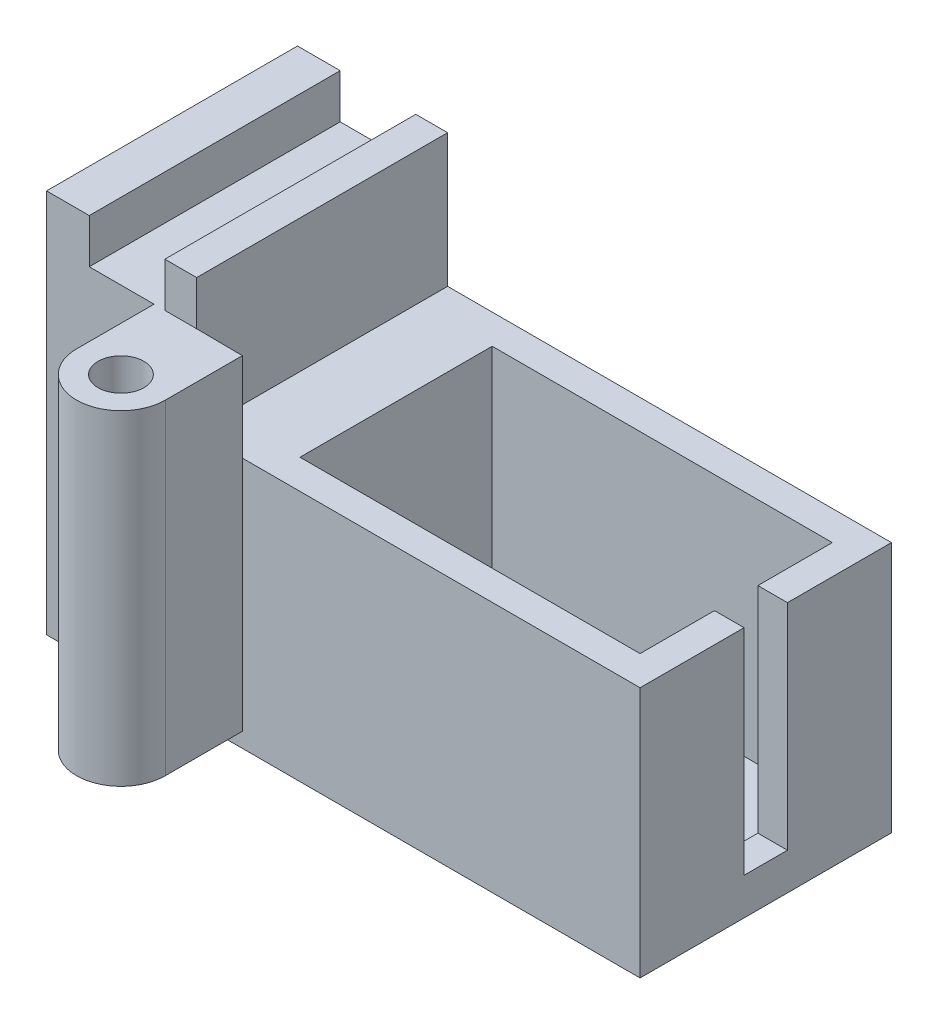
ISO-10303-21;
HEADER;
FILE_DESCRIPTION(('STEP AP214'),'2;1');
FILE_NAME('part.step','',(''),(''),'','','');
FILE_SCHEMA(('AUTOMOTIVE_DESIGN { 1 0 10303 214 1 1 1 1 }'));
ENDSEC;
DATA;
#1=APPLICATION_CONTEXT('core data for automotive mechanical design processes');
#2=APPLICATION_PROTOCOL_DEFINITION('international standard','automotive_design',2000,#1);
#3=PRODUCT_CONTEXT('',#1,'mechanical');
#4=PRODUCT('Part','Part','',(#3));
#5=PRODUCT_RELATED_PRODUCT_CATEGORY('part','',(#4));
#6=PRODUCT_DEFINITION_FORMATION('','',#4);
#7=PRODUCT_DEFINITION_CONTEXT('part definition',#1,'design');
#8=PRODUCT_DEFINITION('design','',#6,#7);
#9=PRODUCT_DEFINITION_SHAPE('','',#8);
#10=(LENGTH_UNIT() NAMED_UNIT(*) SI_UNIT(.MILLI.,.METRE.));
#11=(NAMED_UNIT(*) PLANE_ANGLE_UNIT() SI_UNIT($,.RADIAN.));
#12=(NAMED_UNIT(*) SI_UNIT($,.STERADIAN.) SOLID_ANGLE_UNIT());
#13=UNCERTAINTY_MEASURE_WITH_UNIT(LENGTH_MEASURE(1.E-05),#10,'distance_accuracy_value','');
#14=(GEOMETRIC_REPRESENTATION_CONTEXT(3) GLOBAL_UNCERTAINTY_ASSIGNED_CONTEXT((#13)) GLOBAL_UNIT_ASSIGNED_CONTEXT((#10,
#11,#12)) REPRESENTATION_CONTEXT('',''));
#15=CARTESIAN_POINT('',(0.,0.,0.));
#16=DIRECTION('',(0.,0.,1.));
#17=DIRECTION('',(1.,0.,0.));
#18=AXIS2_PLACEMENT_3D('',#15,#16,#17);
#19=CARTESIAN_POINT('',(-26.668032914112,26.,8.47059048324771));
#20=DIRECTION('',(0.,0.,-1.));
#21=DIRECTION('',(0.,1.,0.));
#22=AXIS2_PLACEMENT_3D('',#19,#20,#21);
#23=PLANE('',#22);
#24=DIRECTION('',(0.,-1.,0.));
#25=VECTOR('',#24,1.);
#26=CARTESIAN_POINT('',(-23.7796119097595,26.,8.47059048324771));
#27=LINE('',#26,#25);
#28=CARTESIAN_POINT('',(-23.7796119097595,26.,8.47059048324771));
#29=VERTEX_POINT('',#28);
#30=CARTESIAN_POINT('',(-23.7796119097595,23.,8.47059048324771));
#31=VERTEX_POINT('',#30);
#32=EDGE_CURVE('E231',#29,#31,#27,.T.);
#33=ORIENTED_EDGE('',*,*,#32,.F.);
#34=DIRECTION('',(1.,0.,0.));
#35=VECTOR('',#34,1.);
#36=CARTESIAN_POINT('',(-26.668032914112,26.,8.47059048324771));
#37=LINE('',#36,#35);
#38=CARTESIAN_POINT('',(-26.668032914112,26.,8.47059048324771));
#39=VERTEX_POINT('',#38);
#40=EDGE_CURVE('E277',#39,#29,#37,.T.);
#41=ORIENTED_EDGE('',*,*,#40,.F.);
#42=DIRECTION('',(0.,-1.,0.));
#43=VECTOR('',#42,1.);
#44=CARTESIAN_POINT('',(-26.668032914112,26.,8.47059048324771));
#45=LINE('',#44,#43);
#46=CARTESIAN_POINT('',(-26.668032914112,0.,8.47059048324771));
#47=VERTEX_POINT('',#46);
#48=EDGE_CURVE('E295',#39,#47,#45,.T.);
#49=ORIENTED_EDGE('',*,*,#48,.T.);
#50=DIRECTION('',(1.,0.,0.));
#51=VECTOR('',#50,1.);
#52=CARTESIAN_POINT('',(-26.668032914112,0.,8.47059048324771));
#53=LINE('',#52,#51);
#54=CARTESIAN_POINT('',(-18.5,0.,8.47059048324771));
#55=VERTEX_POINT('',#54);
#56=EDGE_CURVE('E270',#47,#55,#53,.T.);
#57=ORIENTED_EDGE('',*,*,#56,.T.);
#58=DIRECTION('',(0.,-1.,0.));
#59=VECTOR('',#58,1.);
#60=CARTESIAN_POINT('',(-18.5,0.,8.47059048324771));
#61=LINE('',#60,#59);
#62=CARTESIAN_POINT('',(-18.5,0.999999999999996,8.47059048324771));
#63=VERTEX_POINT('',#62);
#64=EDGE_CURVE('E56',#63,#55,#61,.T.);
#65=ORIENTED_EDGE('',*,*,#64,.F.);
#66=DIRECTION('',(1.,0.,0.));
#67=VECTOR('',#66,1.);
#68=CARTESIAN_POINT('',(-26.668032914112,0.999999999999997,8.47059048324771));
#69=LINE('',#68,#67);
#70=CARTESIAN_POINT('',(-19.3979794014547,0.999999999999997,8.47059048324771));
#71=VERTEX_POINT('',#70);
#72=EDGE_CURVE('E42',#71,#63,#69,.T.);
#73=ORIENTED_EDGE('',*,*,#72,.F.);
#74=DIRECTION('',(0.,1.,0.));
#75=VECTOR('',#74,1.);
#76=CARTESIAN_POINT('',(-19.3979794014547,26.,8.47059048324771));
#77=LINE('',#76,#75);
#78=CARTESIAN_POINT('',(-19.3979794014547,23.,8.47059048324771));
#79=VERTEX_POINT('',#78);
#80=EDGE_CURVE('E396',#71,#79,#77,.T.);
#81=ORIENTED_EDGE('',*,*,#80,.T.);
#82=DIRECTION('',(1.,0.,0.));
#83=VECTOR('',#82,1.);
#84=CARTESIAN_POINT('',(-26.668032914112,23.,8.47059048324771));
#85=LINE('',#84,#83);
#86=EDGE_CURVE('E225',#31,#79,#85,.T.);
#87=ORIENTED_EDGE('',*,*,#86,.F.);
#88=EDGE_LOOP('',(#33,#41,#49,#57,#65,#73,#81,#87));
#89=FACE_BOUND('',#88,.T.);
#90=ADVANCED_FACE('F34',(#89),#23,.F.);
#91=CARTESIAN_POINT('',(0.,26.,0.));
#92=DIRECTION('',(0.,1.,0.));
#93=DIRECTION('',(0.,0.,1.));
#94=AXIS2_PLACEMENT_3D('',#91,#92,#93);
#95=PLANE('',#94);
#96=ORIENTED_EDGE('',*,*,#40,.T.);
#97=DIRECTION('',(0.,0.,-1.));
#98=VECTOR('',#97,1.);
#99=CARTESIAN_POINT('',(-23.7796119097595,26.,0.));
#100=LINE('',#99,#98);
#101=CARTESIAN_POINT('',(-23.7796119097595,26.,-8.5));
#102=VERTEX_POINT('',#101);
#103=EDGE_CURVE('E11',#29,#102,#100,.T.);
#104=ORIENTED_EDGE('',*,*,#103,.T.);
#105=DIRECTION('',(-1.,0.,0.));
#106=VECTOR('',#105,1.);
#107=CARTESIAN_POINT('',(-26.668032914112,26.,-8.5));
#108=LINE('',#107,#106);
#109=CARTESIAN_POINT('',(-26.668032914112,26.,-8.5));
#110=VERTEX_POINT('',#109);
#111=EDGE_CURVE('E282',#102,#110,#108,.T.);
#112=ORIENTED_EDGE('',*,*,#111,.T.);
#113=DIRECTION('',(0.,0.,1.));
#114=VECTOR('',#113,1.);
#115=CARTESIAN_POINT('',(-26.668032914112,26.,-8.5));
#116=LINE('',#115,#114);
#117=EDGE_CURVE('E273',#110,#39,#116,.T.);
#118=ORIENTED_EDGE('',*,*,#117,.T.);
#119=EDGE_LOOP('',(#96,#104,#112,#118));
#120=FACE_BOUND('',#119,.T.);
#121=ADVANCED_FACE('F470',(#120),#95,.T.);
#122=CARTESIAN_POINT('',(-18.5,0.,0.));
#123=DIRECTION('',(-1.,0.,0.));
#124=DIRECTION('',(0.,0.,1.));
#125=AXIS2_PLACEMENT_3D('',#122,#123,#124);
#126=PLANE('',#125);
#127=DIRECTION('',(0.,1.,0.));
#128=VECTOR('',#127,1.);
#129=CARTESIAN_POINT('',(-18.5,0.,8.5));
#130=LINE('',#129,#128);
#131=CARTESIAN_POINT('',(-18.5,0.,8.5));
#132=VERTEX_POINT('',#131);
#133=CARTESIAN_POINT('',(-18.5,0.999999999999997,8.5));
#134=VERTEX_POINT('',#133);
#135=EDGE_CURVE('E300',#132,#134,#130,.T.);
#136=ORIENTED_EDGE('',*,*,#135,.T.);
#137=DIRECTION('',(0.,0.,-1.));
#138=VECTOR('',#137,1.);
#139=CARTESIAN_POINT('',(-18.5,0.999999999999996,0.));
#140=LINE('',#139,#138);
#141=EDGE_CURVE('E263',#134,#63,#140,.T.);
#142=ORIENTED_EDGE('',*,*,#141,.T.);
#143=ORIENTED_EDGE('',*,*,#64,.T.);
#144=DIRECTION('',(0.,0.,1.));
#145=VECTOR('',#144,1.);
#146=CARTESIAN_POINT('',(-18.5,0.,-8.5));
#147=LINE('',#146,#145);
#148=EDGE_CURVE('E298',#55,#132,#147,.T.);
#149=ORIENTED_EDGE('',*,*,#148,.T.);
#150=EDGE_LOOP('',(#136,#142,#143,#149));
#151=FACE_BOUND('',#150,.T.);
#152=ADVANCED_FACE('F405',(#151),#126,.T.);
#153=CARTESIAN_POINT('',(-18.6677867119016,26.,8.47059048324771));
#154=VERTEX_POINT('',#153);
#155=CARTESIAN_POINT('',(-16.5155395499797,26.,8.47059048324771));
#156=VERTEX_POINT('',#155);
#157=EDGE_CURVE('E276',#154,#156,#37,.T.);
#158=ORIENTED_EDGE('',*,*,#157,.F.);
#159=DIRECTION('',(0.,-1.,0.));
#160=VECTOR('',#159,1.);
#161=CARTESIAN_POINT('',(-18.6677867119016,26.,8.47059048324771));
#162=LINE('',#161,#160);
#163=CARTESIAN_POINT('',(-18.6677867119016,23.,8.47059048324771));
#164=VERTEX_POINT('',#163);
#165=EDGE_CURVE('E212',#154,#164,#162,.T.);
#166=ORIENTED_EDGE('',*,*,#165,.T.);
#167=DIRECTION('',(1.,0.,0.));
#168=VECTOR('',#167,1.);
#169=CARTESIAN_POINT('',(-26.668032914112,23.,8.47059048324771));
#170=LINE('',#169,#168);
#171=CARTESIAN_POINT('',(-16.5155395499797,23.,8.47059048324771));
#172=VERTEX_POINT('',#171);
#173=EDGE_CURVE('E220',#164,#172,#170,.T.);
#174=ORIENTED_EDGE('',*,*,#173,.T.);
#175=DIRECTION('',(0.,-1.,0.));
#176=VECTOR('',#175,1.);
#177=CARTESIAN_POINT('',(-16.5155395499797,26.,8.47059048324771));
#178=LINE('',#177,#176);
#179=EDGE_CURVE('E292',#156,#172,#178,.T.);
#180=ORIENTED_EDGE('',*,*,#179,.F.);
#181=EDGE_LOOP('',(#158,#166,#174,#180));
#182=FACE_BOUND('',#181,.T.);
#183=ADVANCED_FACE('F472',(#182),#23,.F.);
#184=CARTESIAN_POINT('',(0.,17.,0.));
#185=DIRECTION('',(0.,1.,0.));
#186=DIRECTION('',(0.,0.,1.));
#187=AXIS2_PLACEMENT_3D('',#184,#185,#186);
#188=PLANE('',#187);
#189=DIRECTION('',(-0.999955507468816,0.,-0.00943308447869537));
#190=VECTOR('',#189,1.);
#191=CARTESIAN_POINT('',(-0.0813698441137592,17.,8.62562229217795));
#192=LINE('',#191,#190);
#193=CARTESIAN_POINT('',(-13.3979794014547,17.,8.5));
#194=VERTEX_POINT('',#193);
#195=CARTESIAN_POINT('',(-16.5155395499797,17.,8.47059048324771));
#196=VERTEX_POINT('',#195);
#197=EDGE_CURVE('E261',#194,#196,#192,.T.);
#198=ORIENTED_EDGE('',*,*,#197,.F.);
#199=DIRECTION('',(1.,0.,0.));
#200=VECTOR('',#199,1.);
#201=CARTESIAN_POINT('',(-13.5,17.,8.5));
#202=LINE('',#201,#200);
#203=CARTESIAN_POINT('',(13.5,17.,8.5));
#204=VERTEX_POINT('',#203);
#205=EDGE_CURVE('E353',#194,#204,#202,.T.);
#206=ORIENTED_EDGE('',*,*,#205,.T.);
#207=DIRECTION('',(0.,0.,-1.));
#208=VECTOR('',#207,1.);
#209=CARTESIAN_POINT('',(13.5,17.,-8.5));
#210=LINE('',#209,#208);
#211=CARTESIAN_POINT('',(13.5,17.,1.46669318242232));
#212=VERTEX_POINT('',#211);
#213=EDGE_CURVE('E356',#204,#212,#210,.T.);
#214=ORIENTED_EDGE('',*,*,#213,.T.);
#215=DIRECTION('',(1.,0.,0.));
#216=VECTOR('',#215,1.);
#217=CARTESIAN_POINT('',(10.4748377480064,17.,1.46669318242232));
#218=LINE('',#217,#216);
#219=CARTESIAN_POINT('',(11.5,17.,1.46669318242232));
#220=VERTEX_POINT('',#219);
#221=EDGE_CURVE('E319',#220,#212,#218,.T.);
#222=ORIENTED_EDGE('',*,*,#221,.F.);
#223=DIRECTION('',(0.,0.,-1.));
#224=VECTOR('',#223,1.);
#225=CARTESIAN_POINT('',(11.5,17.,-6.5));
#226=LINE('',#225,#224);
#227=CARTESIAN_POINT('',(11.5,17.,6.5));
#228=VERTEX_POINT('',#227);
#229=EDGE_CURVE('E331',#228,#220,#226,.T.);
#230=ORIENTED_EDGE('',*,*,#229,.F.);
#231=DIRECTION('',(1.,0.,0.));
#232=VECTOR('',#231,1.);
#233=CARTESIAN_POINT('',(-11.5,17.,6.5));
#234=LINE('',#233,#232);
#235=CARTESIAN_POINT('',(-11.5,17.,6.5));
#236=VERTEX_POINT('',#235);
#237=EDGE_CURVE('E339',#236,#228,#234,.T.);
#238=ORIENTED_EDGE('',*,*,#237,.F.);
#239=DIRECTION('',(0.,0.,1.));
#240=VECTOR('',#239,1.);
#241=CARTESIAN_POINT('',(-11.5,17.,-6.5));
#242=LINE('',#241,#240);
#243=CARTESIAN_POINT('',(-11.5,17.,-6.5));
#244=VERTEX_POINT('',#243);
#245=EDGE_CURVE('E336',#244,#236,#242,.T.);
#246=ORIENTED_EDGE('',*,*,#245,.F.);
#247=DIRECTION('',(-1.,0.,0.));
#248=VECTOR('',#247,1.);
#249=CARTESIAN_POINT('',(-11.5,17.,-6.5));
#250=LINE('',#249,#248);
#251=CARTESIAN_POINT('',(11.5,17.,-6.5));
#252=VERTEX_POINT('',#251);
#253=EDGE_CURVE('E334',#252,#244,#250,.T.);
#254=ORIENTED_EDGE('',*,*,#253,.F.);
#255=CARTESIAN_POINT('',(11.5,17.,-1.46669318242232));
#256=VERTEX_POINT('',#255);
#257=EDGE_CURVE('E330',#256,#252,#226,.T.);
#258=ORIENTED_EDGE('',*,*,#257,.F.);
#259=DIRECTION('',(-1.,0.,0.));
#260=VECTOR('',#259,1.);
#261=CARTESIAN_POINT('',(10.4748377480064,17.,-1.46669318242232));
#262=LINE('',#261,#260);
#263=CARTESIAN_POINT('',(13.5,17.,-1.46669318242232));
#264=VERTEX_POINT('',#263);
#265=EDGE_CURVE('E315',#264,#256,#262,.T.);
#266=ORIENTED_EDGE('',*,*,#265,.F.);
#267=CARTESIAN_POINT('',(13.5,17.,-8.5));
#268=VERTEX_POINT('',#267);
#269=EDGE_CURVE('E355',#264,#268,#210,.T.);
#270=ORIENTED_EDGE('',*,*,#269,.T.);
#271=DIRECTION('',(-1.,0.,0.));
#272=VECTOR('',#271,1.);
#273=CARTESIAN_POINT('',(-13.5,17.,-8.5));
#274=LINE('',#273,#272);
#275=CARTESIAN_POINT('',(-16.5155395499797,17.,-8.5));
#276=VERTEX_POINT('',#275);
#277=EDGE_CURVE('E359',#268,#276,#274,.T.);
#278=ORIENTED_EDGE('',*,*,#277,.T.);
#279=DIRECTION('',(0.,0.,1.));
#280=VECTOR('',#279,1.);
#281=CARTESIAN_POINT('',(-16.5155395499797,17.,0.));
#282=LINE('',#281,#280);
#283=EDGE_CURVE('E393',#276,#196,#282,.T.);
#284=ORIENTED_EDGE('',*,*,#283,.T.);
#285=EDGE_LOOP('',(#198,#206,#214,#222,#230,#238,#246,#254,#258,#266,#270,#278,#284));
#286=FACE_BOUND('',#285,.T.);
#287=ADVANCED_FACE('F483',(#286),#188,.T.);
#288=CARTESIAN_POINT('',(0.,1.5,-8.5));
#289=DIRECTION('',(0.,0.,-1.));
#290=DIRECTION('',(-1.,0.,0.));
#291=AXIS2_PLACEMENT_3D('',#288,#289,#290);
#292=PLANE('',#291);
#293=DIRECTION('',(0.,-1.,0.));
#294=VECTOR('',#293,1.);
#295=CARTESIAN_POINT('',(-18.6677867119016,1.5,-8.5));
#296=LINE('',#295,#294);
#297=CARTESIAN_POINT('',(-18.6677867119016,26.,-8.5));
#298=VERTEX_POINT('',#297);
#299=CARTESIAN_POINT('',(-18.6677867119016,23.,-8.5));
#300=VERTEX_POINT('',#299);
#301=EDGE_CURVE('E201',#298,#300,#296,.T.);
#302=ORIENTED_EDGE('',*,*,#301,.F.);
#303=CARTESIAN_POINT('',(-16.5155395499797,26.,-8.5));
#304=VERTEX_POINT('',#303);
#305=EDGE_CURVE('E283',#304,#298,#108,.T.);
#306=ORIENTED_EDGE('',*,*,#305,.F.);
#307=DIRECTION('',(0.,-1.,0.));
#308=VECTOR('',#307,1.);
#309=CARTESIAN_POINT('',(-16.5155395499797,26.,-8.5));
#310=LINE('',#309,#308);
#311=EDGE_CURVE('E288',#304,#276,#310,.T.);
#312=ORIENTED_EDGE('',*,*,#311,.T.);
#313=ORIENTED_EDGE('',*,*,#277,.F.);
#314=DIRECTION('',(0.,-1.,0.));
#315=VECTOR('',#314,1.);
#316=CARTESIAN_POINT('',(13.5,1.5,-8.5));
#317=LINE('',#316,#315);
#318=CARTESIAN_POINT('',(13.5,0.,-8.5));
#319=VERTEX_POINT('',#318);
#320=EDGE_CURVE('E381',#268,#319,#317,.T.);
#321=ORIENTED_EDGE('',*,*,#320,.T.);
#322=DIRECTION('',(1.,0.,0.));
#323=VECTOR('',#322,1.);
#324=CARTESIAN_POINT('',(0.,0.,-8.5));
#325=LINE('',#324,#323);
#326=CARTESIAN_POINT('',(-26.668032914112,0.,-8.5));
#327=VERTEX_POINT('',#326);
#328=EDGE_CURVE('E373',#327,#319,#325,.T.);
#329=ORIENTED_EDGE('',*,*,#328,.F.);
#330=DIRECTION('',(0.,-1.,0.));
#331=VECTOR('',#330,1.);
#332=CARTESIAN_POINT('',(-26.668032914112,26.,-8.5));
#333=LINE('',#332,#331);
#334=EDGE_CURVE('E285',#110,#327,#333,.T.);
#335=ORIENTED_EDGE('',*,*,#334,.F.);
#336=ORIENTED_EDGE('',*,*,#111,.F.);
#337=DIRECTION('',(0.,-1.,0.));
#338=VECTOR('',#337,1.);
#339=CARTESIAN_POINT('',(-23.7796119097595,1.5,-8.5));
#340=LINE('',#339,#338);
#341=CARTESIAN_POINT('',(-23.7796119097595,23.,-8.5));
#342=VERTEX_POINT('',#341);
#343=EDGE_CURVE('E49',#102,#342,#340,.T.);
#344=ORIENTED_EDGE('',*,*,#343,.T.);
#345=DIRECTION('',(1.,0.,0.));
#346=VECTOR('',#345,1.);
#347=CARTESIAN_POINT('',(0.,23.,-8.5));
#348=LINE('',#347,#346);
#349=EDGE_CURVE('E218',#342,#300,#348,.T.);
#350=ORIENTED_EDGE('',*,*,#349,.T.);
#351=EDGE_LOOP('',(#302,#306,#312,#313,#321,#329,#335,#336,#344,#350));
#352=FACE_BOUND('',#351,.T.);
#353=ADVANCED_FACE('F36',(#352),#292,.T.);
#354=CARTESIAN_POINT('',(0.,1.5,8.5));
#355=DIRECTION('',(0.,0.,-1.));
#356=DIRECTION('',(-1.,0.,0.));
#357=AXIS2_PLACEMENT_3D('',#354,#355,#356);
#358=PLANE('',#357);
#359=ORIENTED_EDGE('',*,*,#205,.F.);
#360=DIRECTION('',(0.,1.,0.));
#361=VECTOR('',#360,1.);
#362=CARTESIAN_POINT('',(-13.3979794014547,0.999999999999997,8.5));
#363=LINE('',#362,#361);
#364=CARTESIAN_POINT('',(-13.3979794014547,0.999999999999997,8.5));
#365=VERTEX_POINT('',#364);
#366=EDGE_CURVE('E255',#365,#194,#363,.T.);
#367=ORIENTED_EDGE('',*,*,#366,.F.);
#368=DIRECTION('',(1.,0.,0.));
#369=VECTOR('',#368,1.);
#370=CARTESIAN_POINT('',(0.,0.999999999999995,8.5));
#371=LINE('',#370,#369);
#372=EDGE_CURVE('E265',#134,#365,#371,.T.);
#373=ORIENTED_EDGE('',*,*,#372,.F.);
#374=ORIENTED_EDGE('',*,*,#135,.F.);
#375=DIRECTION('',(1.,0.,0.));
#376=VECTOR('',#375,1.);
#377=CARTESIAN_POINT('',(0.,0.,8.5));
#378=LINE('',#377,#376);
#379=CARTESIAN_POINT('',(13.5,0.,8.5));
#380=VERTEX_POINT('',#379);
#381=EDGE_CURVE('E375',#132,#380,#378,.T.);
#382=ORIENTED_EDGE('',*,*,#381,.T.);
#383=DIRECTION('',(0.,-1.,0.));
#384=VECTOR('',#383,1.);
#385=CARTESIAN_POINT('',(13.5,1.5,8.5));
#386=LINE('',#385,#384);
#387=EDGE_CURVE('E384',#204,#380,#386,.T.);
#388=ORIENTED_EDGE('',*,*,#387,.F.);
#389=EDGE_LOOP('',(#359,#367,#373,#374,#382,#388));
#390=FACE_BOUND('',#389,.T.);
#391=ADVANCED_FACE('F430',(#390),#358,.F.);
#392=CARTESIAN_POINT('',(13.5,1.5,0.));
#393=DIRECTION('',(1.,0.,0.));
#394=DIRECTION('',(0.,0.,-1.));
#395=AXIS2_PLACEMENT_3D('',#392,#393,#394);
#396=PLANE('',#395);
#397=DIRECTION('',(0.,-1.,0.));
#398=VECTOR('',#397,1.);
#399=CARTESIAN_POINT('',(13.5,1.5,1.46669318242232));
#400=LINE('',#399,#398);
#401=CARTESIAN_POINT('',(13.5,2.5,1.46669318242232));
#402=VERTEX_POINT('',#401);
#403=EDGE_CURVE('E328',#212,#402,#400,.T.);
#404=ORIENTED_EDGE('',*,*,#403,.F.);
#405=ORIENTED_EDGE('',*,*,#213,.F.);
#406=ORIENTED_EDGE('',*,*,#387,.T.);
#407=DIRECTION('',(0.,0.,1.));
#408=VECTOR('',#407,1.);
#409=CARTESIAN_POINT('',(13.5,0.,0.));
#410=LINE('',#409,#408);
#411=EDGE_CURVE('E378',#319,#380,#410,.T.);
#412=ORIENTED_EDGE('',*,*,#411,.F.);
#413=ORIENTED_EDGE('',*,*,#320,.F.);
#414=ORIENTED_EDGE('',*,*,#269,.F.);
#415=DIRECTION('',(0.,1.,0.));
#416=VECTOR('',#415,1.);
#417=CARTESIAN_POINT('',(13.5,1.5,-1.46669318242232));
#418=LINE('',#417,#416);
#419=CARTESIAN_POINT('',(13.5,2.5,-1.46669318242232));
#420=VERTEX_POINT('',#419);
#421=EDGE_CURVE('E326',#420,#264,#418,.T.);
#422=ORIENTED_EDGE('',*,*,#421,.F.);
#423=DIRECTION('',(0.,0.,-1.));
#424=VECTOR('',#423,1.);
#425=CARTESIAN_POINT('',(13.5,2.5,0.));
#426=LINE('',#425,#424);
#427=EDGE_CURVE('E322',#402,#420,#426,.T.);
#428=ORIENTED_EDGE('',*,*,#427,.F.);
#429=EDGE_LOOP('',(#404,#405,#406,#412,#413,#414,#422,#428));
#430=FACE_BOUND('',#429,.T.);
#431=ADVANCED_FACE('F424',(#430),#396,.T.);
#432=CARTESIAN_POINT('',(0.,0.,0.));
#433=DIRECTION('',(0.,1.,0.));
#434=DIRECTION('',(0.,0.,1.));
#435=AXIS2_PLACEMENT_3D('',#432,#433,#434);
#436=PLANE('',#435);
#437=ORIENTED_EDGE('',*,*,#148,.F.);
#438=ORIENTED_EDGE('',*,*,#56,.F.);
#439=DIRECTION('',(0.,0.,1.));
#440=VECTOR('',#439,1.);
#441=CARTESIAN_POINT('',(-26.668032914112,0.,-8.5));
#442=LINE('',#441,#440);
#443=EDGE_CURVE('E267',#327,#47,#442,.T.);
#444=ORIENTED_EDGE('',*,*,#443,.F.);
#445=ORIENTED_EDGE('',*,*,#328,.T.);
#446=ORIENTED_EDGE('',*,*,#411,.T.);
#447=ORIENTED_EDGE('',*,*,#381,.F.);
#448=EDGE_LOOP('',(#437,#438,#444,#445,#446,#447));
#449=FACE_BOUND('',#448,.T.);
#450=CARTESIAN_POINT('',(-6.76542102728206,0.,0.));
#451=DIRECTION('',(0.,1.,0.));
#452=DIRECTION('',(0.,0.,1.));
#453=AXIS2_PLACEMENT_3D('',#450,#451,#452);
#454=CIRCLE('',#453,1.7761452913118);
#455=CARTESIAN_POINT('',(-6.76542102728206,0.,1.7761452913118));
#456=VERTEX_POINT('',#455);
#457=EDGE_CURVE('E312',#456,#456,#454,.T.);
#458=ORIENTED_EDGE('',*,*,#457,.T.);
#459=EDGE_LOOP('',(#458));
#460=FACE_BOUND('',#459,.T.);
#461=CARTESIAN_POINT('',(6.76542102728206,0.,0.));
#462=DIRECTION('',(0.,1.,0.));
#463=DIRECTION('',(0.,0.,1.));
#464=AXIS2_PLACEMENT_3D('',#461,#462,#463);
#465=CIRCLE('',#464,1.7761452913118);
#466=CARTESIAN_POINT('',(6.76542102728206,0.,1.7761452913118));
#467=VERTEX_POINT('',#466);
#468=EDGE_CURVE('E306',#467,#467,#465,.F.);
#469=ORIENTED_EDGE('',*,*,#468,.F.);
#470=EDGE_LOOP('',(#469));
#471=FACE_BOUND('',#470,.T.);
#472=ADVANCED_FACE('F412',(#449,#460,#471),#436,.F.);
#473=CARTESIAN_POINT('',(11.5,17.,-6.5));
#474=DIRECTION('',(-1.,0.,0.));
#475=DIRECTION('',(0.,0.,1.));
#476=AXIS2_PLACEMENT_3D('',#473,#474,#475);
#477=PLANE('',#476);
#478=DIRECTION('',(0.,1.,0.));
#479=VECTOR('',#478,1.);
#480=CARTESIAN_POINT('',(11.5,17.,1.46669318242232));
#481=LINE('',#480,#479);
#482=CARTESIAN_POINT('',(11.5,2.5,1.46669318242232));
#483=VERTEX_POINT('',#482);
#484=EDGE_CURVE('E391',#483,#220,#481,.T.);
#485=ORIENTED_EDGE('',*,*,#484,.F.);
#486=DIRECTION('',(0.,0.,1.));
#487=VECTOR('',#486,1.);
#488=CARTESIAN_POINT('',(11.5,2.5,-6.5));
#489=LINE('',#488,#487);
#490=CARTESIAN_POINT('',(11.5,2.5,-1.46669318242232));
#491=VERTEX_POINT('',#490);
#492=EDGE_CURVE('E386',#491,#483,#489,.T.);
#493=ORIENTED_EDGE('',*,*,#492,.F.);
#494=DIRECTION('',(0.,-1.,0.));
#495=VECTOR('',#494,1.);
#496=CARTESIAN_POINT('',(11.5,17.,-1.46669318242232));
#497=LINE('',#496,#495);
#498=EDGE_CURVE('E388',#256,#491,#497,.T.);
#499=ORIENTED_EDGE('',*,*,#498,.F.);
#500=ORIENTED_EDGE('',*,*,#257,.T.);
#501=DIRECTION('',(0.,-1.,0.));
#502=VECTOR('',#501,1.);
#503=CARTESIAN_POINT('',(11.5,17.,-6.5));
#504=LINE('',#503,#502);
#505=CARTESIAN_POINT('',(11.5,1.5,-6.5));
#506=VERTEX_POINT('',#505);
#507=EDGE_CURVE('E350',#252,#506,#504,.T.);
#508=ORIENTED_EDGE('',*,*,#507,.T.);
#509=DIRECTION('',(0.,0.,1.));
#510=VECTOR('',#509,1.);
#511=CARTESIAN_POINT('',(11.5,1.5,0.));
#512=LINE('',#511,#510);
#513=CARTESIAN_POINT('',(11.5,1.5,6.5));
#514=VERTEX_POINT('',#513);
#515=EDGE_CURVE('E370',#506,#514,#512,.T.);
#516=ORIENTED_EDGE('',*,*,#515,.T.);
#517=DIRECTION('',(0.,-1.,0.));
#518=VECTOR('',#517,1.);
#519=CARTESIAN_POINT('',(11.5,17.,6.5));
#520=LINE('',#519,#518);
#521=EDGE_CURVE('E341',#228,#514,#520,.T.);
#522=ORIENTED_EDGE('',*,*,#521,.F.);
#523=ORIENTED_EDGE('',*,*,#229,.T.);
#524=EDGE_LOOP('',(#485,#493,#499,#500,#508,#516,#522,#523));
#525=FACE_BOUND('',#524,.T.);
#526=ADVANCED_FACE('F520',(#525),#477,.T.);
#527=CARTESIAN_POINT('',(-11.5,17.,-6.5));
#528=DIRECTION('',(0.,0.,1.));
#529=DIRECTION('',(1.,0.,0.));
#530=AXIS2_PLACEMENT_3D('',#527,#528,#529);
#531=PLANE('',#530);
#532=DIRECTION('',(0.,-1.,0.));
#533=VECTOR('',#532,1.);
#534=CARTESIAN_POINT('',(-11.5,17.,-6.5));
#535=LINE('',#534,#533);
#536=CARTESIAN_POINT('',(-11.5,1.5,-6.5));
#537=VERTEX_POINT('',#536);
#538=EDGE_CURVE('E347',#244,#537,#535,.T.);
#539=ORIENTED_EDGE('',*,*,#538,.T.);
#540=DIRECTION('',(1.,0.,0.));
#541=VECTOR('',#540,1.);
#542=CARTESIAN_POINT('',(0.,1.5,-6.5));
#543=LINE('',#542,#541);
#544=EDGE_CURVE('E367',#537,#506,#543,.T.);
#545=ORIENTED_EDGE('',*,*,#544,.T.);
#546=ORIENTED_EDGE('',*,*,#507,.F.);
#547=ORIENTED_EDGE('',*,*,#253,.T.);
#548=EDGE_LOOP('',(#539,#545,#546,#547));
#549=FACE_BOUND('',#548,.T.);
#550=ADVANCED_FACE('F532',(#549),#531,.T.);
#551=CARTESIAN_POINT('',(-11.5,17.,-6.5));
#552=DIRECTION('',(1.,0.,0.));
#553=DIRECTION('',(0.,0.,-1.));
#554=AXIS2_PLACEMENT_3D('',#551,#552,#553);
#555=PLANE('',#554);
#556=DIRECTION('',(0.,-1.,0.));
#557=VECTOR('',#556,1.);
#558=CARTESIAN_POINT('',(-11.5,17.,6.5));
#559=LINE('',#558,#557);
#560=CARTESIAN_POINT('',(-11.5,1.5,6.5));
#561=VERTEX_POINT('',#560);
#562=EDGE_CURVE('E344',#236,#561,#559,.T.);
#563=ORIENTED_EDGE('',*,*,#562,.T.);
#564=DIRECTION('',(0.,0.,-1.));
#565=VECTOR('',#564,1.);
#566=CARTESIAN_POINT('',(-11.5,1.5,0.));
#567=LINE('',#566,#565);
#568=EDGE_CURVE('E364',#561,#537,#567,.T.);
#569=ORIENTED_EDGE('',*,*,#568,.T.);
#570=ORIENTED_EDGE('',*,*,#538,.F.);
#571=ORIENTED_EDGE('',*,*,#245,.T.);
#572=EDGE_LOOP('',(#563,#569,#570,#571));
#573=FACE_BOUND('',#572,.T.);
#574=ADVANCED_FACE('F530',(#573),#555,.T.);
#575=CARTESIAN_POINT('',(-11.5,17.,6.5));
#576=DIRECTION('',(0.,0.,-1.));
#577=DIRECTION('',(-1.,0.,0.));
#578=AXIS2_PLACEMENT_3D('',#575,#576,#577);
#579=PLANE('',#578);
#580=ORIENTED_EDGE('',*,*,#521,.T.);
#581=DIRECTION('',(-1.,0.,0.));
#582=VECTOR('',#581,1.);
#583=CARTESIAN_POINT('',(0.,1.5,6.5));
#584=LINE('',#583,#582);
#585=EDGE_CURVE('E361',#514,#561,#584,.T.);
#586=ORIENTED_EDGE('',*,*,#585,.T.);
#587=ORIENTED_EDGE('',*,*,#562,.F.);
#588=ORIENTED_EDGE('',*,*,#237,.T.);
#589=EDGE_LOOP('',(#580,#586,#587,#588));
#590=FACE_BOUND('',#589,.T.);
#591=ADVANCED_FACE('F527',(#590),#579,.T.);
#592=CARTESIAN_POINT('',(0.,1.5,0.));
#593=DIRECTION('',(0.,1.,0.));
#594=DIRECTION('',(0.,0.,1.));
#595=AXIS2_PLACEMENT_3D('',#592,#593,#594);
#596=PLANE('',#595);
#597=CARTESIAN_POINT('',(6.76542102728206,1.5,0.));
#598=DIRECTION('',(0.,-1.,0.));
#599=DIRECTION('',(0.,0.,1.));
#600=AXIS2_PLACEMENT_3D('',#597,#598,#599);
#601=CIRCLE('',#600,1.7761452913118);
#602=CARTESIAN_POINT('',(6.76542102728206,1.5,1.7761452913118));
#603=VERTEX_POINT('',#602);
#604=EDGE_CURVE('E303',#603,#603,#601,.T.);
#605=ORIENTED_EDGE('',*,*,#604,.T.);
#606=EDGE_LOOP('',(#605));
#607=FACE_BOUND('',#606,.T.);
#608=CARTESIAN_POINT('',(-6.76542102728206,1.5,0.));
#609=DIRECTION('',(0.,1.,0.));
#610=DIRECTION('',(0.,0.,1.));
#611=AXIS2_PLACEMENT_3D('',#608,#609,#610);
#612=CIRCLE('',#611,1.7761452913118);
#613=CARTESIAN_POINT('',(-6.76542102728206,1.5,1.7761452913118));
#614=VERTEX_POINT('',#613);
#615=EDGE_CURVE('E309',#614,#614,#612,.T.);
#616=ORIENTED_EDGE('',*,*,#615,.F.);
#617=EDGE_LOOP('',(#616));
#618=FACE_BOUND('',#617,.T.);
#619=ORIENTED_EDGE('',*,*,#515,.F.);
#620=ORIENTED_EDGE('',*,*,#544,.F.);
#621=ORIENTED_EDGE('',*,*,#568,.F.);
#622=ORIENTED_EDGE('',*,*,#585,.F.);
#623=EDGE_LOOP('',(#619,#620,#621,#622));
#624=FACE_BOUND('',#623,.T.);
#625=ADVANCED_FACE('F535',(#607,#618,#624),#596,.T.);
#626=CARTESIAN_POINT('',(10.4748377480064,2.5,1.46669318242232));
#627=DIRECTION('',(0.,0.,1.));
#628=DIRECTION('',(1.,0.,0.));
#629=AXIS2_PLACEMENT_3D('',#626,#627,#628);
#630=PLANE('',#629);
#631=ORIENTED_EDGE('',*,*,#403,.T.);
#632=DIRECTION('',(1.,0.,0.));
#633=VECTOR('',#632,1.);
#634=CARTESIAN_POINT('',(10.4748377480064,2.5,1.46669318242232));
#635=LINE('',#634,#633);
#636=EDGE_CURVE('E318',#483,#402,#635,.T.);
#637=ORIENTED_EDGE('',*,*,#636,.F.);
#638=ORIENTED_EDGE('',*,*,#484,.T.);
#639=ORIENTED_EDGE('',*,*,#221,.T.);
#640=EDGE_LOOP('',(#631,#637,#638,#639));
#641=FACE_BOUND('',#640,.T.);
#642=ADVANCED_FACE('F517',(#641),#630,.F.);
#643=CARTESIAN_POINT('',(10.4748377480064,2.5,-1.46669318242232));
#644=DIRECTION('',(0.,0.,-1.));
#645=DIRECTION('',(-1.,0.,0.));
#646=AXIS2_PLACEMENT_3D('',#643,#644,#645);
#647=PLANE('',#646);
#648=ORIENTED_EDGE('',*,*,#421,.T.);
#649=ORIENTED_EDGE('',*,*,#265,.T.);
#650=ORIENTED_EDGE('',*,*,#498,.T.);
#651=DIRECTION('',(-1.,0.,0.));
#652=VECTOR('',#651,1.);
#653=CARTESIAN_POINT('',(10.4748377480064,2.5,-1.46669318242232));
#654=LINE('',#653,#652);
#655=EDGE_CURVE('E316',#420,#491,#654,.T.);
#656=ORIENTED_EDGE('',*,*,#655,.F.);
#657=EDGE_LOOP('',(#648,#649,#650,#656));
#658=FACE_BOUND('',#657,.T.);
#659=ADVANCED_FACE('F509',(#658),#647,.F.);
#660=CARTESIAN_POINT('',(0.,2.5,0.));
#661=DIRECTION('',(0.,-1.,0.));
#662=DIRECTION('',(0.,0.,-1.));
#663=AXIS2_PLACEMENT_3D('',#660,#661,#662);
#664=PLANE('',#663);
#665=ORIENTED_EDGE('',*,*,#427,.T.);
#666=ORIENTED_EDGE('',*,*,#655,.T.);
#667=ORIENTED_EDGE('',*,*,#492,.T.);
#668=ORIENTED_EDGE('',*,*,#636,.T.);
#669=EDGE_LOOP('',(#665,#666,#667,#668));
#670=FACE_BOUND('',#669,.T.);
#671=ADVANCED_FACE('F513',(#670),#664,.F.);
#672=CARTESIAN_POINT('',(-6.76542102728206,-13.,0.));
#673=DIRECTION('',(0.,1.,0.));
#674=DIRECTION('',(0.,0.,1.));
#675=AXIS2_PLACEMENT_3D('',#672,#673,#674);
#676=CYLINDRICAL_SURFACE('',#675,1.7761452913118);
#677=ORIENTED_EDGE('',*,*,#615,.T.);
#678=EDGE_LOOP('',(#677));
#679=FACE_BOUND('',#678,.T.);
#680=ORIENTED_EDGE('',*,*,#457,.F.);
#681=EDGE_LOOP('',(#680));
#682=FACE_BOUND('',#681,.T.);
#683=ADVANCED_FACE('F693',(#679,#682),#676,.F.);
#684=CARTESIAN_POINT('',(6.76542102728206,-13.,0.));
#685=DIRECTION('',(0.,1.,0.));
#686=DIRECTION('',(0.,0.,1.));
#687=AXIS2_PLACEMENT_3D('',#684,#685,#686);
#688=CYLINDRICAL_SURFACE('',#687,1.7761452913118);
#689=ORIENTED_EDGE('',*,*,#604,.F.);
#690=EDGE_LOOP('',(#689));
#691=FACE_BOUND('',#690,.T.);
#692=ORIENTED_EDGE('',*,*,#468,.T.);
#693=EDGE_LOOP('',(#692));
#694=FACE_BOUND('',#693,.T.);
#695=ADVANCED_FACE('F567',(#691,#694),#688,.F.);
#696=CARTESIAN_POINT('',(-26.668032914112,26.,-8.5));
#697=DIRECTION('',(1.,0.,0.));
#698=DIRECTION('',(0.,1.,0.));
#699=AXIS2_PLACEMENT_3D('',#696,#697,#698);
#700=PLANE('',#699);
#701=ORIENTED_EDGE('',*,*,#334,.T.);
#702=ORIENTED_EDGE('',*,*,#443,.T.);
#703=ORIENTED_EDGE('',*,*,#48,.F.);
#704=ORIENTED_EDGE('',*,*,#117,.F.);
#705=EDGE_LOOP('',(#701,#702,#703,#704));
#706=FACE_BOUND('',#705,.T.);
#707=ADVANCED_FACE('F416',(#706),#700,.F.);
#708=CARTESIAN_POINT('',(-16.5155395499797,26.,-8.5));
#709=DIRECTION('',(-1.,0.,0.));
#710=DIRECTION('',(0.,-1.,0.));
#711=AXIS2_PLACEMENT_3D('',#708,#709,#710);
#712=PLANE('',#711);
#713=ORIENTED_EDGE('',*,*,#283,.F.);
#714=ORIENTED_EDGE('',*,*,#311,.F.);
#715=DIRECTION('',(0.,0.,-1.));
#716=VECTOR('',#715,1.);
#717=CARTESIAN_POINT('',(-16.5155395499797,26.,-8.5));
#718=LINE('',#717,#716);
#719=EDGE_CURVE('E280',#156,#304,#718,.T.);
#720=ORIENTED_EDGE('',*,*,#719,.F.);
#721=ORIENTED_EDGE('',*,*,#179,.T.);
#722=EDGE_CURVE('E291',#172,#196,#178,.T.);
#723=ORIENTED_EDGE('',*,*,#722,.T.);
#724=EDGE_LOOP('',(#713,#714,#720,#721,#723));
#725=FACE_BOUND('',#724,.T.);
#726=ADVANCED_FACE('F500',(#725),#712,.F.);
#727=DIRECTION('',(0.,0.,-1.));
#728=VECTOR('',#727,1.);
#729=CARTESIAN_POINT('',(-18.6677867119016,26.,0.));
#730=LINE('',#729,#728);
#731=EDGE_CURVE('E207',#154,#298,#730,.T.);
#732=ORIENTED_EDGE('',*,*,#731,.F.);
#733=ORIENTED_EDGE('',*,*,#157,.T.);
#734=ORIENTED_EDGE('',*,*,#719,.T.);
#735=ORIENTED_EDGE('',*,*,#305,.T.);
#736=EDGE_LOOP('',(#732,#733,#734,#735));
#737=FACE_BOUND('',#736,.T.);
#738=ADVANCED_FACE('F479',(#737),#95,.T.);
#739=CARTESIAN_POINT('',(-19.3979794014547,0.999999999999997,13.7092692157575));
#740=DIRECTION('',(-1.,0.,0.));
#741=DIRECTION('',(0.,-1.,0.));
#742=AXIS2_PLACEMENT_3D('',#739,#740,#741);
#743=PLANE('',#742);
#744=ORIENTED_EDGE('',*,*,#80,.F.);
#745=DIRECTION('',(0.,0.,1.));
#746=VECTOR('',#745,1.);
#747=CARTESIAN_POINT('',(-19.3979794014547,0.999999999999997,13.7092692157575));
#748=LINE('',#747,#746);
#749=CARTESIAN_POINT('',(-19.3979794014547,0.999999999999997,13.7092692157575));
#750=VERTEX_POINT('',#749);
#751=EDGE_CURVE('E241',#71,#750,#748,.T.);
#752=ORIENTED_EDGE('',*,*,#751,.T.);
#753=DIRECTION('',(0.,1.,0.));
#754=VECTOR('',#753,1.);
#755=CARTESIAN_POINT('',(-19.3979794014547,0.999999999999997,13.7092692157575));
#756=LINE('',#755,#754);
#757=CARTESIAN_POINT('',(-19.3979794014547,23.,13.7092692157575));
#758=VERTEX_POINT('',#757);
#759=EDGE_CURVE('E252',#750,#758,#756,.T.);
#760=ORIENTED_EDGE('',*,*,#759,.T.);
#761=DIRECTION('',(0.,0.,1.));
#762=VECTOR('',#761,1.);
#763=CARTESIAN_POINT('',(-19.3979794014547,23.,13.7092692157575));
#764=LINE('',#763,#762);
#765=EDGE_CURVE('E238',#79,#758,#764,.T.);
#766=ORIENTED_EDGE('',*,*,#765,.F.);
#767=EDGE_LOOP('',(#744,#752,#760,#766));
#768=FACE_BOUND('',#767,.T.);
#769=ADVANCED_FACE('F443',(#768),#743,.T.);
#770=CARTESIAN_POINT('',(-16.3979794014547,0.999999999999997,13.7092692157575));
#771=DIRECTION('',(0.,1.,0.));
#772=DIRECTION('',(-1.,0.,0.));
#773=AXIS2_PLACEMENT_3D('',#770,#771,#772);
#774=PLANE('',#773);
#775=CARTESIAN_POINT('',(-16.3979794014547,0.999999999999997,13.7092692157575));
#776=DIRECTION('',(0.,1.,0.));
#777=DIRECTION('',(-1.,0.,0.));
#778=AXIS2_PLACEMENT_3D('',#775,#776,#777);
#779=CIRCLE('',#778,1.55);
#780=CARTESIAN_POINT('',(-17.9479794014547,0.999999999999998,13.7092692157575));
#781=VERTEX_POINT('',#780);
#782=EDGE_CURVE('E222',#781,#781,#779,.T.);
#783=ORIENTED_EDGE('',*,*,#782,.T.);
#784=EDGE_LOOP('',(#783));
#785=FACE_BOUND('',#784,.T.);
#786=ORIENTED_EDGE('',*,*,#141,.F.);
#787=ORIENTED_EDGE('',*,*,#372,.T.);
#788=DIRECTION('',(0.,0.,-1.));
#789=VECTOR('',#788,1.);
#790=CARTESIAN_POINT('',(-13.3979794014547,0.999999999999997,8.5));
#791=LINE('',#790,#789);
#792=CARTESIAN_POINT('',(-13.3979794014547,0.999999999999997,13.7092692157575));
#793=VERTEX_POINT('',#792);
#794=EDGE_CURVE('E237',#793,#365,#791,.T.);
#795=ORIENTED_EDGE('',*,*,#794,.F.);
#796=CARTESIAN_POINT('',(-16.3979794014547,0.999999999999997,13.7092692157575));
#797=DIRECTION('',(0.,1.,0.));
#798=DIRECTION('',(-1.,0.,0.));
#799=AXIS2_PLACEMENT_3D('',#796,#797,#798);
#800=CIRCLE('',#799,3.);
#801=EDGE_CURVE('E234',#750,#793,#800,.T.);
#802=ORIENTED_EDGE('',*,*,#801,.F.);
#803=ORIENTED_EDGE('',*,*,#751,.F.);
#804=ORIENTED_EDGE('',*,*,#72,.T.);
#805=EDGE_LOOP('',(#786,#787,#795,#802,#803,#804));
#806=FACE_BOUND('',#805,.T.);
#807=ADVANCED_FACE('F401',(#785,#806),#774,.F.);
#808=CARTESIAN_POINT('',(-16.3979794014547,23.,13.7092692157575));
#809=DIRECTION('',(0.,1.,0.));
#810=DIRECTION('',(-1.,0.,0.));
#811=AXIS2_PLACEMENT_3D('',#808,#809,#810);
#812=PLANE('',#811);
#813=CARTESIAN_POINT('',(-16.3979794014547,23.,13.7092692157575));
#814=DIRECTION('',(0.,1.,0.));
#815=DIRECTION('',(-1.,0.,0.));
#816=AXIS2_PLACEMENT_3D('',#813,#814,#815);
#817=CIRCLE('',#816,1.55);
#818=CARTESIAN_POINT('',(-17.9479794014547,23.,13.7092692157575));
#819=VERTEX_POINT('',#818);
#820=EDGE_CURVE('E450',#819,#819,#817,.T.);
#821=ORIENTED_EDGE('',*,*,#820,.F.);
#822=EDGE_LOOP('',(#821));
#823=FACE_BOUND('',#822,.T.);
#824=ORIENTED_EDGE('',*,*,#173,.F.);
#825=DIRECTION('',(0.,0.,1.));
#826=VECTOR('',#825,1.);
#827=CARTESIAN_POINT('',(-18.6677867119016,23.,-10.6139927841122));
#828=LINE('',#827,#826);
#829=EDGE_CURVE('E204',#300,#164,#828,.T.);
#830=ORIENTED_EDGE('',*,*,#829,.F.);
#831=ORIENTED_EDGE('',*,*,#349,.F.);
#832=DIRECTION('',(0.,0.,1.));
#833=VECTOR('',#832,1.);
#834=CARTESIAN_POINT('',(-23.7796119097595,23.,-10.6139927841122));
#835=LINE('',#834,#833);
#836=EDGE_CURVE('E221',#342,#31,#835,.T.);
#837=ORIENTED_EDGE('',*,*,#836,.T.);
#838=ORIENTED_EDGE('',*,*,#86,.T.);
#839=ORIENTED_EDGE('',*,*,#765,.T.);
#840=CARTESIAN_POINT('',(-16.3979794014547,23.,13.7092692157575));
#841=DIRECTION('',(0.,1.,0.));
#842=DIRECTION('',(-1.,0.,0.));
#843=AXIS2_PLACEMENT_3D('',#840,#841,#842);
#844=CIRCLE('',#843,3.);
#845=CARTESIAN_POINT('',(-13.3979794014547,23.,13.7092692157575));
#846=VERTEX_POINT('',#845);
#847=EDGE_CURVE('E233',#758,#846,#844,.T.);
#848=ORIENTED_EDGE('',*,*,#847,.T.);
#849=DIRECTION('',(0.,0.,-1.));
#850=VECTOR('',#849,1.);
#851=CARTESIAN_POINT('',(-13.3979794014547,23.,8.5));
#852=LINE('',#851,#850);
#853=CARTESIAN_POINT('',(-13.3979794014547,23.,8.5));
#854=VERTEX_POINT('',#853);
#855=EDGE_CURVE('E246',#846,#854,#852,.T.);
#856=ORIENTED_EDGE('',*,*,#855,.T.);
#857=DIRECTION('',(-0.999955507468816,0.,-0.00943308447869537));
#858=VECTOR('',#857,1.);
#859=CARTESIAN_POINT('',(-19.3979794014547,23.,8.44339897480495));
#860=LINE('',#859,#858);
#861=EDGE_CURVE('E249',#854,#172,#860,.T.);
#862=ORIENTED_EDGE('',*,*,#861,.T.);
#863=EDGE_LOOP('',(#824,#830,#831,#837,#838,#839,#848,#856,#862));
#864=FACE_BOUND('',#863,.T.);
#865=ADVANCED_FACE('F216',(#823,#864),#812,.T.);
#866=CARTESIAN_POINT('',(-16.3979794014547,0.999999999999997,13.7092692157575));
#867=DIRECTION('',(0.,1.,0.));
#868=DIRECTION('',(-1.,0.,0.));
#869=AXIS2_PLACEMENT_3D('',#866,#867,#868);
#870=CYLINDRICAL_SURFACE('',#869,3.);
#871=ORIENTED_EDGE('',*,*,#847,.F.);
#872=ORIENTED_EDGE('',*,*,#759,.F.);
#873=ORIENTED_EDGE('',*,*,#801,.T.);
#874=DIRECTION('',(0.,1.,0.));
#875=VECTOR('',#874,1.);
#876=CARTESIAN_POINT('',(-13.3979794014547,0.999999999999997,13.7092692157575));
#877=LINE('',#876,#875);
#878=EDGE_CURVE('E243',#793,#846,#877,.T.);
#879=ORIENTED_EDGE('',*,*,#878,.T.);
#880=EDGE_LOOP('',(#871,#872,#873,#879));
#881=FACE_BOUND('',#880,.T.);
#882=ADVANCED_FACE('F439',(#881),#870,.T.);
#883=CARTESIAN_POINT('',(-19.3979794014547,0.999999999999997,8.44339897480495));
#884=DIRECTION('',(0.00943308447869537,0.,-0.999955507468816));
#885=DIRECTION('',(-0.999955507468816,0.,-0.00943308447869537));
#886=AXIS2_PLACEMENT_3D('',#883,#884,#885);
#887=PLANE('',#886);
#888=EDGE_CURVE('E258',#194,#854,#363,.T.);
#889=ORIENTED_EDGE('',*,*,#888,.F.);
#890=ORIENTED_EDGE('',*,*,#197,.T.);
#891=ORIENTED_EDGE('',*,*,#722,.F.);
#892=ORIENTED_EDGE('',*,*,#861,.F.);
#893=EDGE_LOOP('',(#889,#890,#891,#892));
#894=FACE_BOUND('',#893,.T.);
#895=ADVANCED_FACE('F464',(#894),#887,.T.);
#896=CARTESIAN_POINT('',(-13.3979794014547,0.999999999999997,8.5));
#897=DIRECTION('',(1.,0.,0.));
#898=DIRECTION('',(0.,1.,0.));
#899=AXIS2_PLACEMENT_3D('',#896,#897,#898);
#900=PLANE('',#899);
#901=ORIENTED_EDGE('',*,*,#855,.F.);
#902=ORIENTED_EDGE('',*,*,#878,.F.);
#903=ORIENTED_EDGE('',*,*,#794,.T.);
#904=ORIENTED_EDGE('',*,*,#366,.T.);
#905=ORIENTED_EDGE('',*,*,#888,.T.);
#906=EDGE_LOOP('',(#901,#902,#903,#904,#905));
#907=FACE_BOUND('',#906,.T.);
#908=ADVANCED_FACE('F435',(#907),#900,.T.);
#909=CARTESIAN_POINT('',(-23.7796119097595,29.,-10.6139927841122));
#910=DIRECTION('',(1.,0.,0.));
#911=DIRECTION('',(0.,0.,-1.));
#912=AXIS2_PLACEMENT_3D('',#909,#910,#911);
#913=PLANE('',#912);
#914=ORIENTED_EDGE('',*,*,#32,.T.);
#915=ORIENTED_EDGE('',*,*,#836,.F.);
#916=ORIENTED_EDGE('',*,*,#343,.F.);
#917=ORIENTED_EDGE('',*,*,#103,.F.);
#918=EDGE_LOOP('',(#914,#915,#916,#917));
#919=FACE_BOUND('',#918,.T.);
#920=ADVANCED_FACE('F613',(#919),#913,.T.);
#921=CARTESIAN_POINT('',(-18.6677867119016,29.,-10.6139927841122));
#922=DIRECTION('',(1.,0.,0.));
#923=DIRECTION('',(0.,0.,-1.));
#924=AXIS2_PLACEMENT_3D('',#921,#922,#923);
#925=PLANE('',#924);
#926=ORIENTED_EDGE('',*,*,#731,.T.);
#927=ORIENTED_EDGE('',*,*,#301,.T.);
#928=ORIENTED_EDGE('',*,*,#829,.T.);
#929=ORIENTED_EDGE('',*,*,#165,.F.);
#930=EDGE_LOOP('',(#926,#927,#928,#929));
#931=FACE_BOUND('',#930,.T.);
#932=ADVANCED_FACE('F203',(#931),#925,.F.);
#933=CARTESIAN_POINT('',(-16.3979794014547,-8.,13.7092692157575));
#934=DIRECTION('',(0.,1.,0.));
#935=DIRECTION('',(-1.,0.,0.));
#936=AXIS2_PLACEMENT_3D('',#933,#934,#935);
#937=CYLINDRICAL_SURFACE('',#936,1.55);
#938=ORIENTED_EDGE('',*,*,#820,.T.);
#939=EDGE_LOOP('',(#938));
#940=FACE_BOUND('',#939,.T.);
#941=ORIENTED_EDGE('',*,*,#782,.F.);
#942=EDGE_LOOP('',(#941));
#943=FACE_BOUND('',#942,.T.);
#944=ADVANCED_FACE('F454',(#940,#943),#937,.F.);
#945=CLOSED_SHELL('',(#90,#121,#152,#183,#287,#353,#391,#431,#472,#526,#550,#574,#591,#625,#642,
#659,#671,#683,#695,#707,#726,#738,#769,#807,#865,#882,#895,#908,#920,#932,#944));
#946=MANIFOLD_SOLID_BREP('B2',#945);
#947=ADVANCED_BREP_SHAPE_REPRESENTATION('',(#18,#946),#14);
#948=SHAPE_DEFINITION_REPRESENTATION(#9,#947);
ENDSEC;
END-ISO-10303-21;
